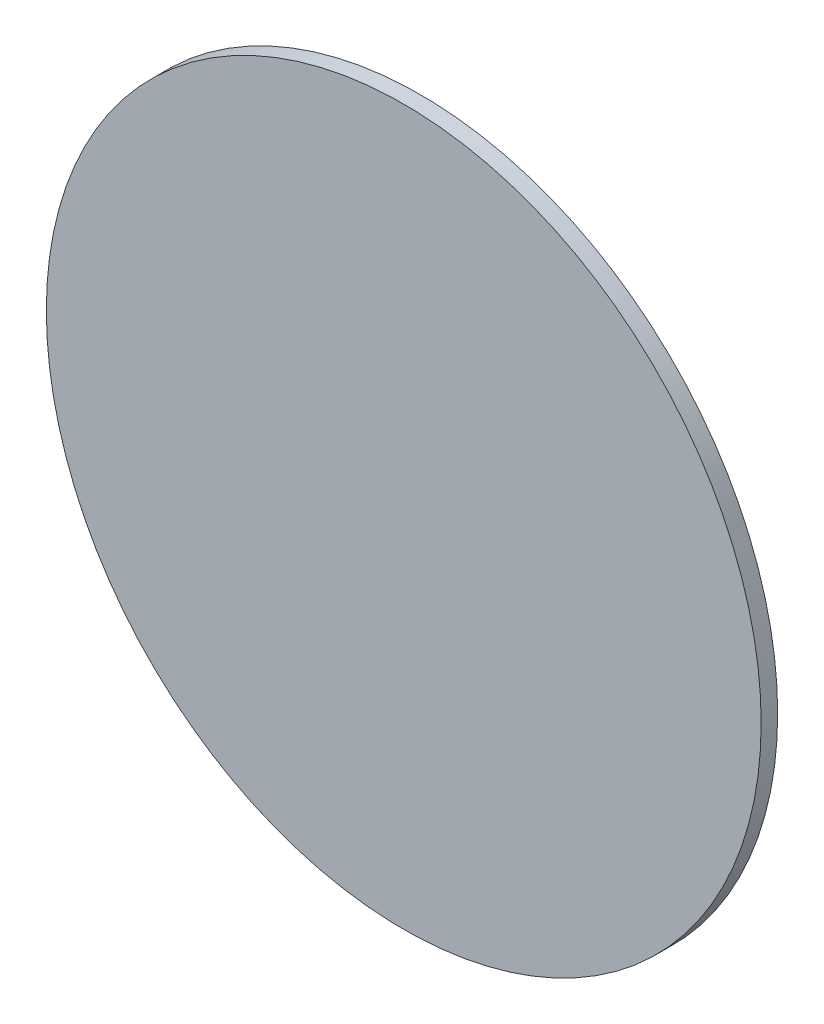
ISO-10303-21;
HEADER;
FILE_DESCRIPTION(('STEP AP214'),'2;1');
FILE_NAME('part.step','',(''),(''),'','','');
FILE_SCHEMA(('AUTOMOTIVE_DESIGN { 1 0 10303 214 1 1 1 1 }'));
ENDSEC;
DATA;
#1=APPLICATION_CONTEXT('core data for automotive mechanical design processes');
#2=APPLICATION_PROTOCOL_DEFINITION('international standard','automotive_design',2000,#1);
#3=PRODUCT_CONTEXT('',#1,'mechanical');
#4=PRODUCT('Part','Part','',(#3));
#5=PRODUCT_RELATED_PRODUCT_CATEGORY('part','',(#4));
#6=PRODUCT_DEFINITION_FORMATION('','',#4);
#7=PRODUCT_DEFINITION_CONTEXT('part definition',#1,'design');
#8=PRODUCT_DEFINITION('design','',#6,#7);
#9=PRODUCT_DEFINITION_SHAPE('','',#8);
#10=(LENGTH_UNIT() NAMED_UNIT(*) SI_UNIT(.MILLI.,.METRE.));
#11=(NAMED_UNIT(*) PLANE_ANGLE_UNIT() SI_UNIT($,.RADIAN.));
#12=(NAMED_UNIT(*) SI_UNIT($,.STERADIAN.) SOLID_ANGLE_UNIT());
#13=UNCERTAINTY_MEASURE_WITH_UNIT(LENGTH_MEASURE(1.E-05),#10,'distance_accuracy_value','');
#14=(GEOMETRIC_REPRESENTATION_CONTEXT(3) GLOBAL_UNCERTAINTY_ASSIGNED_CONTEXT((#13)) GLOBAL_UNIT_ASSIGNED_CONTEXT((#10,
#11,#12)) REPRESENTATION_CONTEXT('',''));
#15=CARTESIAN_POINT('',(0.,0.,0.));
#16=DIRECTION('',(0.,0.,1.));
#17=DIRECTION('',(1.,0.,0.));
#18=AXIS2_PLACEMENT_3D('',#15,#16,#17);
#19=CARTESIAN_POINT('',(0.,0.,0.));
#20=DIRECTION('',(0.,0.,1.));
#21=DIRECTION('',(1.,0.,0.));
#22=AXIS2_PLACEMENT_3D('',#19,#20,#21);
#23=PLANE('',#22);
#24=CARTESIAN_POINT('',(0.,0.,0.));
#25=DIRECTION('',(0.,0.,1.));
#26=DIRECTION('',(1.,0.,0.));
#27=AXIS2_PLACEMENT_3D('',#24,#25,#26);
#28=CIRCLE('',#27,16.);
#29=CARTESIAN_POINT('',(16.,0.,0.));
#30=VERTEX_POINT('',#29);
#31=EDGE_CURVE('E36',#30,#30,#28,.T.);
#32=ORIENTED_EDGE('',*,*,#31,.F.);
#33=EDGE_LOOP('',(#32));
#34=FACE_BOUND('',#33,.T.);
#35=CARTESIAN_POINT('',(0.,0.,0.));
#36=DIRECTION('',(0.,0.,1.));
#37=DIRECTION('',(1.,0.,0.));
#38=AXIS2_PLACEMENT_3D('',#35,#36,#37);
#39=CIRCLE('',#38,11.5);
#40=CARTESIAN_POINT('',(11.5,0.,0.));
#41=VERTEX_POINT('',#40);
#42=EDGE_CURVE('E43',#41,#41,#39,.T.);
#43=ORIENTED_EDGE('',*,*,#42,.T.);
#44=EDGE_LOOP('',(#43));
#45=FACE_BOUND('',#44,.T.);
#46=ADVANCED_FACE('F32',(#34,#45),#23,.F.);
#47=CARTESIAN_POINT('',(0.,0.,19.));
#48=DIRECTION('',(0.,0.,-1.));
#49=DIRECTION('',(-1.,0.,0.));
#50=AXIS2_PLACEMENT_3D('',#47,#48,#49);
#51=CYLINDRICAL_SURFACE('',#50,16.);
#52=CARTESIAN_POINT('',(0.,0.,19.));
#53=DIRECTION('',(0.,0.,1.));
#54=DIRECTION('',(1.,0.,0.));
#55=AXIS2_PLACEMENT_3D('',#52,#53,#54);
#56=CIRCLE('',#55,16.);
#57=CARTESIAN_POINT('',(16.,0.,19.));
#58=VERTEX_POINT('',#57);
#59=EDGE_CURVE('E10',#58,#58,#56,.T.);
#60=ORIENTED_EDGE('',*,*,#59,.F.);
#61=EDGE_LOOP('',(#60));
#62=FACE_BOUND('',#61,.T.);
#63=ORIENTED_EDGE('',*,*,#31,.T.);
#64=EDGE_LOOP('',(#63));
#65=FACE_BOUND('',#64,.T.);
#66=ADVANCED_FACE('F34',(#62,#65),#51,.T.);
#67=CARTESIAN_POINT('',(0.,0.,19.));
#68=DIRECTION('',(0.,0.,-1.));
#69=DIRECTION('',(-1.,0.,0.));
#70=AXIS2_PLACEMENT_3D('',#67,#68,#69);
#71=CYLINDRICAL_SURFACE('',#70,11.5);
#72=CARTESIAN_POINT('',(0.,0.,19.));
#73=DIRECTION('',(0.,0.,1.));
#74=DIRECTION('',(1.,0.,0.));
#75=AXIS2_PLACEMENT_3D('',#72,#73,#74);
#76=CIRCLE('',#75,11.5);
#77=CARTESIAN_POINT('',(11.5,0.,19.));
#78=VERTEX_POINT('',#77);
#79=EDGE_CURVE('E47',#78,#78,#76,.T.);
#80=ORIENTED_EDGE('',*,*,#79,.T.);
#81=EDGE_LOOP('',(#80));
#82=FACE_BOUND('',#81,.T.);
#83=ORIENTED_EDGE('',*,*,#42,.F.);
#84=EDGE_LOOP('',(#83));
#85=FACE_BOUND('',#84,.T.);
#86=ADVANCED_FACE('F74',(#82,#85),#71,.F.);
#87=CARTESIAN_POINT('',(0.,0.,19.));
#88=DIRECTION('',(0.,0.,1.));
#89=DIRECTION('',(1.,0.,0.));
#90=AXIS2_PLACEMENT_3D('',#87,#88,#89);
#91=PLANE('',#90);
#92=ORIENTED_EDGE('',*,*,#79,.F.);
#93=EDGE_LOOP('',(#92));
#94=FACE_BOUND('',#93,.T.);
#95=ADVANCED_FACE('F62',(#94),#91,.F.);
#96=CARTESIAN_POINT('',(0.,0.,22.));
#97=DIRECTION('',(0.,0.,-1.));
#98=DIRECTION('',(-1.,0.,0.));
#99=AXIS2_PLACEMENT_3D('',#96,#97,#98);
#100=CYLINDRICAL_SURFACE('',#99,65.);
#101=CARTESIAN_POINT('',(0.,0.,22.));
#102=DIRECTION('',(0.,0.,1.));
#103=DIRECTION('',(1.,0.,0.));
#104=AXIS2_PLACEMENT_3D('',#101,#102,#103);
#105=CIRCLE('',#104,65.);
#106=CARTESIAN_POINT('',(65.,0.,22.));
#107=VERTEX_POINT('',#106);
#108=EDGE_CURVE('E50',#107,#107,#105,.T.);
#109=ORIENTED_EDGE('',*,*,#108,.F.);
#110=EDGE_LOOP('',(#109));
#111=FACE_BOUND('',#110,.T.);
#112=CARTESIAN_POINT('',(0.,0.,19.));
#113=DIRECTION('',(0.,0.,1.));
#114=DIRECTION('',(1.,0.,0.));
#115=AXIS2_PLACEMENT_3D('',#112,#113,#114);
#116=CIRCLE('',#115,65.);
#117=CARTESIAN_POINT('',(65.,0.,19.));
#118=VERTEX_POINT('',#117);
#119=EDGE_CURVE('E51',#118,#118,#116,.T.);
#120=ORIENTED_EDGE('',*,*,#119,.T.);
#121=EDGE_LOOP('',(#120));
#122=FACE_BOUND('',#121,.T.);
#123=ADVANCED_FACE('F59',(#111,#122),#100,.T.);
#124=CARTESIAN_POINT('',(0.,0.,22.));
#125=DIRECTION('',(0.,0.,1.));
#126=DIRECTION('',(1.,0.,0.));
#127=AXIS2_PLACEMENT_3D('',#124,#125,#126);
#128=PLANE('',#127);
#129=ORIENTED_EDGE('',*,*,#108,.T.);
#130=EDGE_LOOP('',(#129));
#131=FACE_BOUND('',#130,.T.);
#132=ADVANCED_FACE('F57',(#131),#128,.T.);
#133=ORIENTED_EDGE('',*,*,#59,.T.);
#134=EDGE_LOOP('',(#133));
#135=FACE_BOUND('',#134,.T.);
#136=ORIENTED_EDGE('',*,*,#119,.F.);
#137=EDGE_LOOP('',(#136));
#138=FACE_BOUND('',#137,.T.);
#139=ADVANCED_FACE('F66',(#135,#138),#91,.F.);
#140=CLOSED_SHELL('',(#46,#66,#86,#95,#123,#132,#139));
#141=MANIFOLD_SOLID_BREP('B2',#140);
#142=ADVANCED_BREP_SHAPE_REPRESENTATION('',(#18,#141),#14);
#143=SHAPE_DEFINITION_REPRESENTATION(#9,#142);
ENDSEC;
END-ISO-10303-21;
